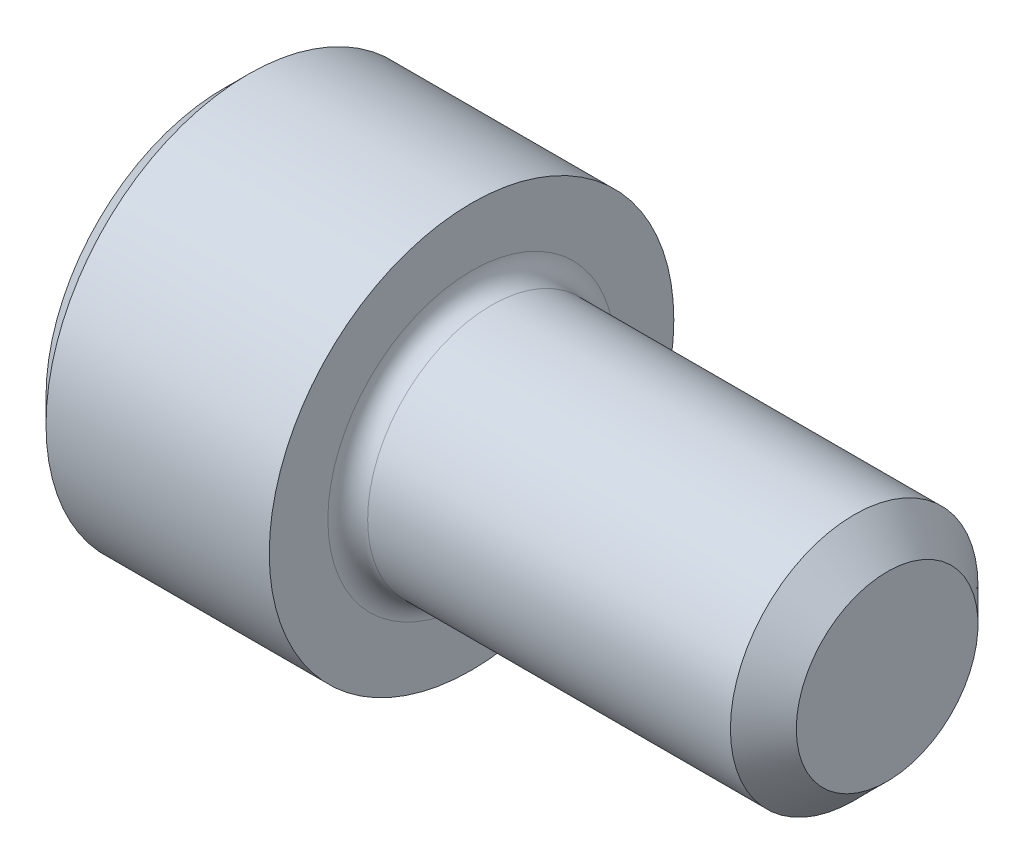
ISO-10303-21;
HEADER;
FILE_DESCRIPTION(('STEP AP214'),'2;1');
FILE_NAME('part.step','',(''),(''),'','','');
FILE_SCHEMA(('AUTOMOTIVE_DESIGN { 1 0 10303 214 1 1 1 1 }'));
ENDSEC;
DATA;
#1=APPLICATION_CONTEXT('core data for automotive mechanical design processes');
#2=APPLICATION_PROTOCOL_DEFINITION('international standard','automotive_design',2000,#1);
#3=PRODUCT_CONTEXT('',#1,'mechanical');
#4=PRODUCT('Part','Part','',(#3));
#5=PRODUCT_RELATED_PRODUCT_CATEGORY('part','',(#4));
#6=PRODUCT_DEFINITION_FORMATION('','',#4);
#7=PRODUCT_DEFINITION_CONTEXT('part definition',#1,'design');
#8=PRODUCT_DEFINITION('design','',#6,#7);
#9=PRODUCT_DEFINITION_SHAPE('','',#8);
#10=(LENGTH_UNIT() NAMED_UNIT(*) SI_UNIT(.MILLI.,.METRE.));
#11=(NAMED_UNIT(*) PLANE_ANGLE_UNIT() SI_UNIT($,.RADIAN.));
#12=(NAMED_UNIT(*) SI_UNIT($,.STERADIAN.) SOLID_ANGLE_UNIT());
#13=UNCERTAINTY_MEASURE_WITH_UNIT(LENGTH_MEASURE(1.E-05),#10,'distance_accuracy_value','');
#14=(GEOMETRIC_REPRESENTATION_CONTEXT(3) GLOBAL_UNCERTAINTY_ASSIGNED_CONTEXT((#13)) GLOBAL_UNIT_ASSIGNED_CONTEXT((#10,
#11,#12)) REPRESENTATION_CONTEXT('',''));
#15=CARTESIAN_POINT('',(0.,0.,0.));
#16=DIRECTION('',(0.,0.,1.));
#17=DIRECTION('',(1.,0.,0.));
#18=AXIS2_PLACEMENT_3D('',#15,#16,#17);
#19=CARTESIAN_POINT('',(0.,0.,0.));
#20=DIRECTION('',(-1.,0.,0.));
#21=DIRECTION('',(0.,0.,1.));
#22=AXIS2_PLACEMENT_3D('',#19,#20,#21);
#23=PLANE('',#22);
#24=DIRECTION('',(0.,-0.499999999999999,0.866025403784439));
#25=VECTOR('',#24,1.);
#26=CARTESIAN_POINT('',(0.,1.37848150271716,0.));
#27=LINE('',#26,#25);
#28=CARTESIAN_POINT('',(0.,1.37848150271716,0.));
#29=VERTEX_POINT('',#28);
#30=CARTESIAN_POINT('',(0.,0.689240751358582,1.1938));
#31=VERTEX_POINT('',#30);
#32=EDGE_CURVE('E264',#29,#31,#27,.T.);
#33=ORIENTED_EDGE('',*,*,#32,.T.);
#34=DIRECTION('',(0.,1.,0.));
#35=VECTOR('',#34,1.);
#36=CARTESIAN_POINT('',(0.,-0.689240751358569,1.1938));
#37=LINE('',#36,#35);
#38=CARTESIAN_POINT('',(0.,-0.689240751358569,1.1938));
#39=VERTEX_POINT('',#38);
#40=EDGE_CURVE('E124',#39,#31,#37,.T.);
#41=ORIENTED_EDGE('',*,*,#40,.F.);
#42=DIRECTION('',(0.,-0.500000000000001,-0.866025403784438));
#43=VECTOR('',#42,1.);
#44=CARTESIAN_POINT('',(0.,-0.689240751358569,1.1938));
#45=LINE('',#44,#43);
#46=CARTESIAN_POINT('',(0.,-1.37848150271715,0.));
#47=VERTEX_POINT('',#46);
#48=EDGE_CURVE('E267',#39,#47,#45,.T.);
#49=ORIENTED_EDGE('',*,*,#48,.T.);
#50=DIRECTION('',(0.,0.499999999999999,-0.866025403784439));
#51=VECTOR('',#50,1.);
#52=CARTESIAN_POINT('',(0.,-1.37848150271715,0.));
#53=LINE('',#52,#51);
#54=CARTESIAN_POINT('',(0.,-0.689240751358572,-1.1938));
#55=VERTEX_POINT('',#54);
#56=EDGE_CURVE('E270',#47,#55,#53,.T.);
#57=ORIENTED_EDGE('',*,*,#56,.T.);
#58=DIRECTION('',(0.,-1.,0.));
#59=VECTOR('',#58,1.);
#60=CARTESIAN_POINT('',(0.,0.689240751358578,-1.1938));
#61=LINE('',#60,#59);
#62=CARTESIAN_POINT('',(0.,0.689240751358578,-1.1938));
#63=VERTEX_POINT('',#62);
#64=EDGE_CURVE('E273',#63,#55,#61,.T.);
#65=ORIENTED_EDGE('',*,*,#64,.F.);
#66=DIRECTION('',(0.,-0.500000000000001,-0.866025403784438));
#67=VECTOR('',#66,1.);
#68=CARTESIAN_POINT('',(0.,1.37848150271716,0.));
#69=LINE('',#68,#67);
#70=EDGE_CURVE('E119',#29,#63,#69,.T.);
#71=ORIENTED_EDGE('',*,*,#70,.F.);
#72=EDGE_LOOP('',(#33,#41,#49,#57,#65,#71));
#73=FACE_BOUND('',#72,.T.);
#74=CARTESIAN_POINT('',(0.,0.,0.));
#75=DIRECTION('',(-1.,0.,0.));
#76=DIRECTION('',(0.,0.,1.));
#77=AXIS2_PLACEMENT_3D('',#74,#75,#76);
#78=CIRCLE('',#77,2.0447);
#79=CARTESIAN_POINT('',(0.,0.,2.0447));
#80=VERTEX_POINT('',#79);
#81=EDGE_CURVE('E148',#80,#80,#78,.T.);
#82=ORIENTED_EDGE('',*,*,#81,.T.);
#83=EDGE_LOOP('',(#82));
#84=FACE_BOUND('',#83,.T.);
#85=ADVANCED_FACE('F32',(#73,#84),#23,.T.);
#86=CARTESIAN_POINT('',(0.,0.,0.));
#87=DIRECTION('',(1.,0.,0.));
#88=DIRECTION('',(0.,0.,-1.));
#89=AXIS2_PLACEMENT_3D('',#86,#87,#88);
#90=CONICAL_SURFACE('',#89,2.0447,0.785398163397436);
#91=CARTESIAN_POINT('',(0.279400000000006,0.,0.));
#92=DIRECTION('',(-1.,0.,0.));
#93=DIRECTION('',(0.,0.,1.));
#94=AXIS2_PLACEMENT_3D('',#91,#92,#93);
#95=CIRCLE('',#94,2.3241);
#96=CARTESIAN_POINT('',(0.279400000000006,0.,2.3241));
#97=VERTEX_POINT('',#96);
#98=EDGE_CURVE('E145',#97,#97,#95,.T.);
#99=ORIENTED_EDGE('',*,*,#98,.T.);
#100=EDGE_LOOP('',(#99));
#101=FACE_BOUND('',#100,.T.);
#102=ORIENTED_EDGE('',*,*,#81,.F.);
#103=EDGE_LOOP('',(#102));
#104=FACE_BOUND('',#103,.T.);
#105=ADVANCED_FACE('F169',(#101,#104),#90,.T.);
#106=CARTESIAN_POINT('',(-31.75,0.,0.));
#107=DIRECTION('',(-1.,0.,0.));
#108=DIRECTION('',(0.,0.,1.));
#109=AXIS2_PLACEMENT_3D('',#106,#107,#108);
#110=CYLINDRICAL_SURFACE('',#109,2.3241);
#111=CARTESIAN_POINT('',(2.84480000000001,0.,0.));
#112=DIRECTION('',(-1.,0.,0.));
#113=DIRECTION('',(0.,0.,1.));
#114=AXIS2_PLACEMENT_3D('',#111,#112,#113);
#115=CIRCLE('',#114,2.3241);
#116=CARTESIAN_POINT('',(2.84480000000001,0.,2.3241));
#117=VERTEX_POINT('',#116);
#118=EDGE_CURVE('E142',#117,#117,#115,.T.);
#119=ORIENTED_EDGE('',*,*,#118,.T.);
#120=EDGE_LOOP('',(#119));
#121=FACE_BOUND('',#120,.T.);
#122=ORIENTED_EDGE('',*,*,#98,.F.);
#123=EDGE_LOOP('',(#122));
#124=FACE_BOUND('',#123,.T.);
#125=ADVANCED_FACE('F174',(#121,#124),#110,.T.);
#126=CARTESIAN_POINT('',(2.8448,2.3241,0.));
#127=DIRECTION('',(1.,0.,0.));
#128=DIRECTION('',(0.,0.,-1.));
#129=AXIS2_PLACEMENT_3D('',#126,#127,#128);
#130=PLANE('',#129);
#131=CARTESIAN_POINT('',(2.8448,0.,0.));
#132=DIRECTION('',(1.,0.,0.));
#133=DIRECTION('',(0.,0.,-1.));
#134=AXIS2_PLACEMENT_3D('',#131,#132,#133);
#135=CIRCLE('',#134,1.651);
#136=CARTESIAN_POINT('',(2.8448,0.,-1.651));
#137=VERTEX_POINT('',#136);
#138=EDGE_CURVE('E40',#137,#137,#135,.F.);
#139=ORIENTED_EDGE('',*,*,#138,.T.);
#140=EDGE_LOOP('',(#139));
#141=FACE_BOUND('',#140,.T.);
#142=ORIENTED_EDGE('',*,*,#118,.F.);
#143=EDGE_LOOP('',(#142));
#144=FACE_BOUND('',#143,.T.);
#145=ADVANCED_FACE('F153',(#141,#144),#130,.T.);
#146=CARTESIAN_POINT('',(-31.75,0.,0.));
#147=DIRECTION('',(-1.,0.,0.));
#148=DIRECTION('',(0.,0.,1.));
#149=AXIS2_PLACEMENT_3D('',#146,#147,#148);
#150=CYLINDRICAL_SURFACE('',#149,1.4224);
#151=CARTESIAN_POINT('',(3.0734,0.,0.));
#152=DIRECTION('',(1.,0.,0.));
#153=DIRECTION('',(0.,0.,-1.));
#154=AXIS2_PLACEMENT_3D('',#151,#152,#153);
#155=CIRCLE('',#154,1.4224);
#156=CARTESIAN_POINT('',(3.0734,0.,-1.4224));
#157=VERTEX_POINT('',#156);
#158=EDGE_CURVE('E11',#157,#157,#155,.T.);
#159=ORIENTED_EDGE('',*,*,#158,.T.);
#160=EDGE_LOOP('',(#159));
#161=FACE_BOUND('',#160,.T.);
#162=CARTESIAN_POINT('',(7.24154000000002,0.,0.));
#163=DIRECTION('',(-1.,0.,0.));
#164=DIRECTION('',(0.,0.,1.));
#165=AXIS2_PLACEMENT_3D('',#162,#163,#164);
#166=CIRCLE('',#165,1.4224);
#167=CARTESIAN_POINT('',(7.24154000000002,0.,1.4224));
#168=VERTEX_POINT('',#167);
#169=EDGE_CURVE('E139',#168,#168,#166,.T.);
#170=ORIENTED_EDGE('',*,*,#169,.T.);
#171=EDGE_LOOP('',(#170));
#172=FACE_BOUND('',#171,.T.);
#173=ADVANCED_FACE('F184',(#161,#172),#150,.T.);
#174=CARTESIAN_POINT('',(7.62,0.,0.));
#175=DIRECTION('',(-1.,0.,0.));
#176=DIRECTION('',(0.,0.,1.));
#177=AXIS2_PLACEMENT_3D('',#174,#175,#176);
#178=CONICAL_SURFACE('',#177,1.04394,0.785398163397471);
#179=ORIENTED_EDGE('',*,*,#169,.F.);
#180=EDGE_LOOP('',(#179));
#181=FACE_BOUND('',#180,.T.);
#182=CARTESIAN_POINT('',(7.62,0.,0.));
#183=DIRECTION('',(-1.,0.,0.));
#184=DIRECTION('',(0.,0.,1.));
#185=AXIS2_PLACEMENT_3D('',#182,#183,#184);
#186=CIRCLE('',#185,1.04394);
#187=CARTESIAN_POINT('',(7.62,0.,1.04394));
#188=VERTEX_POINT('',#187);
#189=EDGE_CURVE('E135',#188,#188,#186,.T.);
#190=ORIENTED_EDGE('',*,*,#189,.T.);
#191=EDGE_LOOP('',(#190));
#192=FACE_BOUND('',#191,.T.);
#193=ADVANCED_FACE('F164',(#181,#192),#178,.T.);
#194=CARTESIAN_POINT('',(7.62,1.04394,0.));
#195=DIRECTION('',(1.,0.,0.));
#196=DIRECTION('',(0.,0.,-1.));
#197=AXIS2_PLACEMENT_3D('',#194,#195,#196);
#198=PLANE('',#197);
#199=ORIENTED_EDGE('',*,*,#189,.F.);
#200=EDGE_LOOP('',(#199));
#201=FACE_BOUND('',#200,.T.);
#202=ADVANCED_FACE('F157',(#201),#198,.T.);
#203=CARTESIAN_POINT('',(3.0734,0.,0.));
#204=DIRECTION('',(1.,0.,0.));
#205=DIRECTION('',(0.,0.,-1.));
#206=AXIS2_PLACEMENT_3D('',#203,#204,#205);
#207=TOROIDAL_SURFACE('',#206,1.651,0.2286);
#208=ORIENTED_EDGE('',*,*,#158,.F.);
#209=EDGE_LOOP('',(#208));
#210=FACE_BOUND('',#209,.T.);
#211=ORIENTED_EDGE('',*,*,#138,.F.);
#212=EDGE_LOOP('',(#211));
#213=FACE_BOUND('',#212,.T.);
#214=ADVANCED_FACE('F34',(#210,#213),#207,.F.);
#215=CARTESIAN_POINT('',(1.2954,1.37848150271716,0.));
#216=DIRECTION('',(0.,-0.866025403784439,-0.499999999999999));
#217=DIRECTION('',(0.,0.499999999999999,-0.866025403784439));
#218=AXIS2_PLACEMENT_3D('',#215,#216,#217);
#219=PLANE('',#218);
#220=ORIENTED_EDGE('',*,*,#32,.F.);
#221=DIRECTION('',(-1.,0.,0.));
#222=VECTOR('',#221,1.);
#223=CARTESIAN_POINT('',(1.2954,1.37848150271716,0.));
#224=LINE('',#223,#222);
#225=CARTESIAN_POINT('',(1.2954,1.37848150271716,0.));
#226=VERTEX_POINT('',#225);
#227=EDGE_CURVE('E263',#226,#29,#224,.T.);
#228=ORIENTED_EDGE('',*,*,#227,.F.);
#229=DIRECTION('',(0.,-0.499999999999999,0.866025403784439));
#230=VECTOR('',#229,1.);
#231=CARTESIAN_POINT('',(1.2954,1.37848150271716,0.));
#232=LINE('',#231,#230);
#233=CARTESIAN_POINT('',(1.29540000000001,1.03386112703786,0.596899999999998));
#234=VERTEX_POINT('',#233);
#235=EDGE_CURVE('E47',#226,#234,#232,.T.);
#236=ORIENTED_EDGE('',*,*,#235,.T.);
#237=CARTESIAN_POINT('',(1.2954,0.689240751358582,1.1938));
#238=VERTEX_POINT('',#237);
#239=EDGE_CURVE('E105',#234,#238,#232,.T.);
#240=ORIENTED_EDGE('',*,*,#239,.T.);
#241=DIRECTION('',(-1.,0.,0.));
#242=VECTOR('',#241,1.);
#243=CARTESIAN_POINT('',(1.2954,0.689240751358582,1.1938));
#244=LINE('',#243,#242);
#245=EDGE_CURVE('E117',#238,#31,#244,.T.);
#246=ORIENTED_EDGE('',*,*,#245,.T.);
#247=EDGE_LOOP('',(#220,#228,#236,#240,#246));
#248=FACE_BOUND('',#247,.T.);
#249=ADVANCED_FACE('F116',(#248),#219,.T.);
#250=CARTESIAN_POINT('',(1.2954,-0.689240751358569,1.1938));
#251=DIRECTION('',(0.,0.,1.));
#252=DIRECTION('',(0.,-1.,0.));
#253=AXIS2_PLACEMENT_3D('',#250,#251,#252);
#254=PLANE('',#253);
#255=ORIENTED_EDGE('',*,*,#40,.T.);
#256=ORIENTED_EDGE('',*,*,#245,.F.);
#257=DIRECTION('',(0.,1.,0.));
#258=VECTOR('',#257,1.);
#259=CARTESIAN_POINT('',(1.2954,-0.689240751358569,1.1938));
#260=LINE('',#259,#258);
#261=CARTESIAN_POINT('',(1.2954,0.,1.1938));
#262=VERTEX_POINT('',#261);
#263=EDGE_CURVE('E103',#262,#238,#260,.T.);
#264=ORIENTED_EDGE('',*,*,#263,.F.);
#265=CARTESIAN_POINT('',(1.2954,-0.689240751358569,1.1938));
#266=VERTEX_POINT('',#265);
#267=EDGE_CURVE('E113',#266,#262,#260,.T.);
#268=ORIENTED_EDGE('',*,*,#267,.F.);
#269=DIRECTION('',(-1.,0.,0.));
#270=VECTOR('',#269,1.);
#271=CARTESIAN_POINT('',(1.2954,-0.689240751358569,1.1938));
#272=LINE('',#271,#270);
#273=EDGE_CURVE('E126',#266,#39,#272,.T.);
#274=ORIENTED_EDGE('',*,*,#273,.T.);
#275=EDGE_LOOP('',(#255,#256,#264,#268,#274));
#276=FACE_BOUND('',#275,.T.);
#277=ADVANCED_FACE('F121',(#276),#254,.F.);
#278=CARTESIAN_POINT('',(1.2954,-0.689240751358569,1.1938));
#279=DIRECTION('',(0.,0.866025403784438,-0.500000000000001));
#280=DIRECTION('',(0.,0.500000000000001,0.866025403784438));
#281=AXIS2_PLACEMENT_3D('',#278,#279,#280);
#282=PLANE('',#281);
#283=ORIENTED_EDGE('',*,*,#48,.F.);
#284=ORIENTED_EDGE('',*,*,#273,.F.);
#285=DIRECTION('',(0.,-0.500000000000001,-0.866025403784438));
#286=VECTOR('',#285,1.);
#287=CARTESIAN_POINT('',(1.2954,-0.689240751358569,1.1938));
#288=LINE('',#287,#286);
#289=CARTESIAN_POINT('',(1.2954,-1.03386112703786,0.596899999999999));
#290=VERTEX_POINT('',#289);
#291=EDGE_CURVE('E244',#266,#290,#288,.T.);
#292=ORIENTED_EDGE('',*,*,#291,.T.);
#293=CARTESIAN_POINT('',(1.2954,-1.37848150271715,0.));
#294=VERTEX_POINT('',#293);
#295=EDGE_CURVE('E246',#290,#294,#288,.T.);
#296=ORIENTED_EDGE('',*,*,#295,.T.);
#297=DIRECTION('',(-1.,0.,0.));
#298=VECTOR('',#297,1.);
#299=CARTESIAN_POINT('',(1.2954,-1.37848150271715,0.));
#300=LINE('',#299,#298);
#301=EDGE_CURVE('E131',#294,#47,#300,.T.);
#302=ORIENTED_EDGE('',*,*,#301,.T.);
#303=EDGE_LOOP('',(#283,#284,#292,#296,#302));
#304=FACE_BOUND('',#303,.T.);
#305=ADVANCED_FACE('F196',(#304),#282,.T.);
#306=CARTESIAN_POINT('',(1.2954,-1.37848150271715,0.));
#307=DIRECTION('',(0.,0.866025403784439,0.499999999999999));
#308=DIRECTION('',(0.,-0.499999999999999,0.866025403784439));
#309=AXIS2_PLACEMENT_3D('',#306,#307,#308);
#310=PLANE('',#309);
#311=ORIENTED_EDGE('',*,*,#56,.F.);
#312=ORIENTED_EDGE('',*,*,#301,.F.);
#313=DIRECTION('',(0.,0.499999999999999,-0.866025403784439));
#314=VECTOR('',#313,1.);
#315=CARTESIAN_POINT('',(1.2954,-1.37848150271715,0.));
#316=LINE('',#315,#314);
#317=CARTESIAN_POINT('',(1.2954,-1.03386112703786,-0.596899999999997));
#318=VERTEX_POINT('',#317);
#319=EDGE_CURVE('E249',#294,#318,#316,.T.);
#320=ORIENTED_EDGE('',*,*,#319,.T.);
#321=CARTESIAN_POINT('',(1.2954,-0.689240751358572,-1.1938));
#322=VERTEX_POINT('',#321);
#323=EDGE_CURVE('E253',#318,#322,#316,.T.);
#324=ORIENTED_EDGE('',*,*,#323,.T.);
#325=DIRECTION('',(-1.,0.,0.));
#326=VECTOR('',#325,1.);
#327=CARTESIAN_POINT('',(1.2954,-0.689240751358572,-1.1938));
#328=LINE('',#327,#326);
#329=EDGE_CURVE('E282',#322,#55,#328,.T.);
#330=ORIENTED_EDGE('',*,*,#329,.T.);
#331=EDGE_LOOP('',(#311,#312,#320,#324,#330));
#332=FACE_BOUND('',#331,.T.);
#333=ADVANCED_FACE('F199',(#332),#310,.T.);
#334=CARTESIAN_POINT('',(1.2954,0.689240751358578,-1.1938));
#335=DIRECTION('',(0.,0.,-1.));
#336=DIRECTION('',(0.,1.,0.));
#337=AXIS2_PLACEMENT_3D('',#334,#335,#336);
#338=PLANE('',#337);
#339=ORIENTED_EDGE('',*,*,#64,.T.);
#340=ORIENTED_EDGE('',*,*,#329,.F.);
#341=DIRECTION('',(0.,-1.,0.));
#342=VECTOR('',#341,1.);
#343=CARTESIAN_POINT('',(1.2954,0.689240751358578,-1.1938));
#344=LINE('',#343,#342);
#345=CARTESIAN_POINT('',(1.2954,0.,-1.1938));
#346=VERTEX_POINT('',#345);
#347=EDGE_CURVE('E257',#346,#322,#344,.T.);
#348=ORIENTED_EDGE('',*,*,#347,.F.);
#349=CARTESIAN_POINT('',(1.2954,0.689240751358578,-1.1938));
#350=VERTEX_POINT('',#349);
#351=EDGE_CURVE('E258',#350,#346,#344,.T.);
#352=ORIENTED_EDGE('',*,*,#351,.F.);
#353=DIRECTION('',(-1.,0.,0.));
#354=VECTOR('',#353,1.);
#355=CARTESIAN_POINT('',(1.2954,0.689240751358578,-1.1938));
#356=LINE('',#355,#354);
#357=EDGE_CURVE('E279',#350,#63,#356,.T.);
#358=ORIENTED_EDGE('',*,*,#357,.T.);
#359=EDGE_LOOP('',(#339,#340,#348,#352,#358));
#360=FACE_BOUND('',#359,.T.);
#361=ADVANCED_FACE('F203',(#360),#338,.F.);
#362=CARTESIAN_POINT('',(1.2954,1.37848150271716,0.));
#363=DIRECTION('',(0.,0.866025403784438,-0.500000000000001));
#364=DIRECTION('',(0.,0.500000000000001,0.866025403784438));
#365=AXIS2_PLACEMENT_3D('',#362,#363,#364);
#366=PLANE('',#365);
#367=ORIENTED_EDGE('',*,*,#70,.T.);
#368=ORIENTED_EDGE('',*,*,#357,.F.);
#369=DIRECTION('',(0.,-0.500000000000001,-0.866025403784438));
#370=VECTOR('',#369,1.);
#371=CARTESIAN_POINT('',(1.2954,1.37848150271716,0.));
#372=LINE('',#371,#370);
#373=CARTESIAN_POINT('',(1.2954,1.03386112703787,-0.596900000000004));
#374=VERTEX_POINT('',#373);
#375=EDGE_CURVE('E261',#374,#350,#372,.T.);
#376=ORIENTED_EDGE('',*,*,#375,.F.);
#377=EDGE_CURVE('E235',#226,#374,#372,.T.);
#378=ORIENTED_EDGE('',*,*,#377,.F.);
#379=ORIENTED_EDGE('',*,*,#227,.T.);
#380=EDGE_LOOP('',(#367,#368,#376,#378,#379));
#381=FACE_BOUND('',#380,.T.);
#382=ADVANCED_FACE('F207',(#381),#366,.F.);
#383=CARTESIAN_POINT('',(1.2954,0.689240751358581,1.1938));
#384=DIRECTION('',(-1.,0.,0.));
#385=DIRECTION('',(0.,0.,1.));
#386=AXIS2_PLACEMENT_3D('',#383,#384,#385);
#387=PLANE('',#386);
#388=CARTESIAN_POINT('',(1.29540000000001,0.,0.));
#389=DIRECTION('',(-1.,0.,0.));
#390=DIRECTION('',(0.,0.,1.));
#391=AXIS2_PLACEMENT_3D('',#388,#389,#390);
#392=CIRCLE('',#391,1.1938);
#393=EDGE_CURVE('E125',#290,#262,#392,.T.);
#394=ORIENTED_EDGE('',*,*,#393,.F.);
#395=ORIENTED_EDGE('',*,*,#291,.F.);
#396=ORIENTED_EDGE('',*,*,#267,.T.);
#397=EDGE_LOOP('',(#394,#395,#396));
#398=FACE_BOUND('',#397,.T.);
#399=ADVANCED_FACE('F211',(#398),#387,.T.);
#400=EDGE_CURVE('E129',#318,#290,#392,.T.);
#401=ORIENTED_EDGE('',*,*,#400,.F.);
#402=ORIENTED_EDGE('',*,*,#319,.F.);
#403=ORIENTED_EDGE('',*,*,#295,.F.);
#404=EDGE_LOOP('',(#401,#402,#403));
#405=FACE_BOUND('',#404,.T.);
#406=ADVANCED_FACE('F214',(#405),#387,.T.);
#407=EDGE_CURVE('E288',#346,#318,#392,.T.);
#408=ORIENTED_EDGE('',*,*,#407,.F.);
#409=ORIENTED_EDGE('',*,*,#347,.T.);
#410=ORIENTED_EDGE('',*,*,#323,.F.);
#411=EDGE_LOOP('',(#408,#409,#410));
#412=FACE_BOUND('',#411,.T.);
#413=ADVANCED_FACE('F219',(#412),#387,.T.);
#414=EDGE_CURVE('E238',#374,#346,#392,.T.);
#415=ORIENTED_EDGE('',*,*,#414,.F.);
#416=ORIENTED_EDGE('',*,*,#375,.T.);
#417=ORIENTED_EDGE('',*,*,#351,.T.);
#418=EDGE_LOOP('',(#415,#416,#417));
#419=FACE_BOUND('',#418,.T.);
#420=ADVANCED_FACE('F226',(#419),#387,.T.);
#421=EDGE_CURVE('E136',#234,#374,#392,.T.);
#422=ORIENTED_EDGE('',*,*,#421,.F.);
#423=ORIENTED_EDGE('',*,*,#235,.F.);
#424=ORIENTED_EDGE('',*,*,#377,.T.);
#425=EDGE_LOOP('',(#422,#423,#424));
#426=FACE_BOUND('',#425,.T.);
#427=ADVANCED_FACE('F222',(#426),#387,.T.);
#428=EDGE_CURVE('E108',#262,#234,#392,.T.);
#429=ORIENTED_EDGE('',*,*,#428,.F.);
#430=ORIENTED_EDGE('',*,*,#263,.T.);
#431=ORIENTED_EDGE('',*,*,#239,.F.);
#432=EDGE_LOOP('',(#429,#430,#431));
#433=FACE_BOUND('',#432,.T.);
#434=ADVANCED_FACE('F104',(#433),#387,.T.);
#435=CARTESIAN_POINT('',(1.29540000000001,0.,0.));
#436=DIRECTION('',(-1.,0.,0.));
#437=DIRECTION('',(0.,0.,1.));
#438=AXIS2_PLACEMENT_3D('',#435,#436,#437);
#439=CONICAL_SURFACE('',#438,1.1938,1.04719755119659);
#440=CARTESIAN_POINT('',(1.98464075135859,0.,0.));
#441=VERTEX_POINT('',#440);
#442=VERTEX_LOOP('',#441);
#443=FACE_BOUND('',#442,.T.);
#444=ORIENTED_EDGE('',*,*,#428,.T.);
#445=ORIENTED_EDGE('',*,*,#421,.T.);
#446=ORIENTED_EDGE('',*,*,#414,.T.);
#447=ORIENTED_EDGE('',*,*,#407,.T.);
#448=ORIENTED_EDGE('',*,*,#400,.T.);
#449=ORIENTED_EDGE('',*,*,#393,.T.);
#450=EDGE_LOOP('',(#444,#445,#446,#447,#448,#449));
#451=FACE_BOUND('',#450,.T.);
#452=ADVANCED_FACE('F191',(#443,#451),#439,.F.);
#453=CLOSED_SHELL('',(#85,#105,#125,#145,#173,#193,#202,#214,#249,#277,#305,#333,#361,#382,#399,
#406,#413,#420,#427,#434,#452));
#454=MANIFOLD_SOLID_BREP('B2',#453);
#455=ADVANCED_BREP_SHAPE_REPRESENTATION('',(#18,#454),#14);
#456=SHAPE_DEFINITION_REPRESENTATION(#9,#455);
ENDSEC;
END-ISO-10303-21;
